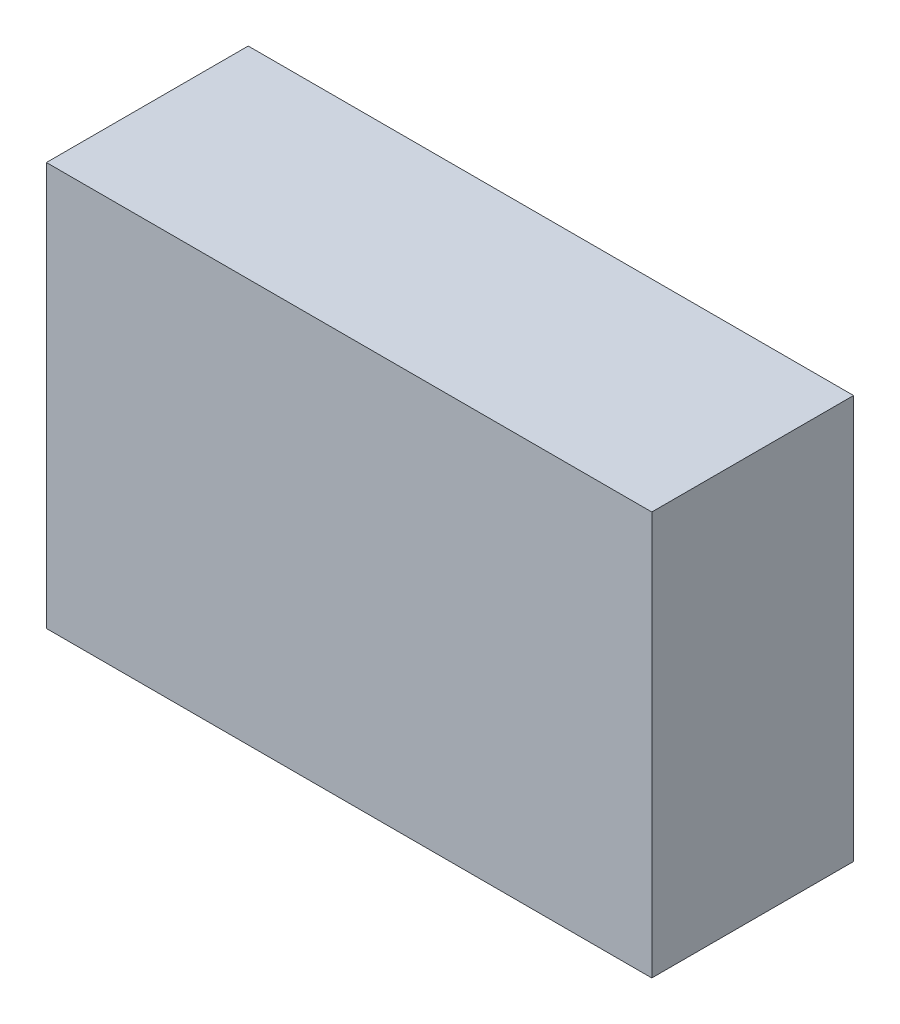
ISO-10303-21;
HEADER;
FILE_DESCRIPTION(('STEP AP214'),'2;1');
FILE_NAME('part.step','',(''),(''),'','','');
FILE_SCHEMA(('AUTOMOTIVE_DESIGN { 1 0 10303 214 1 1 1 1 }'));
ENDSEC;
DATA;
#1=APPLICATION_CONTEXT('core data for automotive mechanical design processes');
#2=APPLICATION_PROTOCOL_DEFINITION('international standard','automotive_design',2000,#1);
#3=PRODUCT_CONTEXT('',#1,'mechanical');
#4=PRODUCT('Part','Part','',(#3));
#5=PRODUCT_RELATED_PRODUCT_CATEGORY('part','',(#4));
#6=PRODUCT_DEFINITION_FORMATION('','',#4);
#7=PRODUCT_DEFINITION_CONTEXT('part definition',#1,'design');
#8=PRODUCT_DEFINITION('design','',#6,#7);
#9=PRODUCT_DEFINITION_SHAPE('','',#8);
#10=(LENGTH_UNIT() NAMED_UNIT(*) SI_UNIT(.MILLI.,.METRE.));
#11=(NAMED_UNIT(*) PLANE_ANGLE_UNIT() SI_UNIT($,.RADIAN.));
#12=(NAMED_UNIT(*) SI_UNIT($,.STERADIAN.) SOLID_ANGLE_UNIT());
#13=UNCERTAINTY_MEASURE_WITH_UNIT(LENGTH_MEASURE(1.E-05),#10,'distance_accuracy_value','');
#14=(GEOMETRIC_REPRESENTATION_CONTEXT(3) GLOBAL_UNCERTAINTY_ASSIGNED_CONTEXT((#13)) GLOBAL_UNIT_ASSIGNED_CONTEXT((#10,
#11,#12)) REPRESENTATION_CONTEXT('',''));
#15=CARTESIAN_POINT('',(0.,0.,0.));
#16=DIRECTION('',(0.,0.,1.));
#17=DIRECTION('',(1.,0.,0.));
#18=AXIS2_PLACEMENT_3D('',#15,#16,#17);
#19=CARTESIAN_POINT('',(0.,0.,25.4));
#20=DIRECTION('',(1.,0.,0.));
#21=DIRECTION('',(0.,0.,-1.));
#22=AXIS2_PLACEMENT_3D('',#19,#20,#21);
#23=PLANE('',#22);
#24=DIRECTION('',(0.,-1.,0.));
#25=VECTOR('',#24,1.);
#26=CARTESIAN_POINT('',(0.,0.,-25.4));
#27=LINE('',#26,#25);
#28=CARTESIAN_POINT('',(0.,101.6,-25.4));
#29=VERTEX_POINT('',#28);
#30=CARTESIAN_POINT('',(0.,0.,-25.4));
#31=VERTEX_POINT('',#30);
#32=EDGE_CURVE('E111',#29,#31,#27,.T.);
#33=ORIENTED_EDGE('',*,*,#32,.T.);
#34=DIRECTION('',(0.,0.,-1.));
#35=VECTOR('',#34,1.);
#36=CARTESIAN_POINT('',(0.,0.,25.4));
#37=LINE('',#36,#35);
#38=CARTESIAN_POINT('',(0.,0.,25.4));
#39=VERTEX_POINT('',#38);
#40=EDGE_CURVE('E11',#39,#31,#37,.T.);
#41=ORIENTED_EDGE('',*,*,#40,.F.);
#42=DIRECTION('',(0.,-1.,0.));
#43=VECTOR('',#42,1.);
#44=CARTESIAN_POINT('',(0.,0.,25.4));
#45=LINE('',#44,#43);
#46=CARTESIAN_POINT('',(0.,101.6,25.4));
#47=VERTEX_POINT('',#46);
#48=EDGE_CURVE('E95',#47,#39,#45,.T.);
#49=ORIENTED_EDGE('',*,*,#48,.F.);
#50=DIRECTION('',(0.,0.,-1.));
#51=VECTOR('',#50,1.);
#52=CARTESIAN_POINT('',(0.,101.6,25.4));
#53=LINE('',#52,#51);
#54=EDGE_CURVE('E107',#47,#29,#53,.T.);
#55=ORIENTED_EDGE('',*,*,#54,.T.);
#56=EDGE_LOOP('',(#33,#41,#49,#55));
#57=FACE_BOUND('',#56,.T.);
#58=ADVANCED_FACE('F43',(#57),#23,.F.);
#59=CARTESIAN_POINT('',(0.,0.,25.4));
#60=DIRECTION('',(0.,1.,0.));
#61=DIRECTION('',(0.,0.,1.));
#62=AXIS2_PLACEMENT_3D('',#59,#60,#61);
#63=PLANE('',#62);
#64=DIRECTION('',(1.,0.,0.));
#65=VECTOR('',#64,1.);
#66=CARTESIAN_POINT('',(0.,0.,-25.4));
#67=LINE('',#66,#65);
#68=CARTESIAN_POINT('',(152.4,0.,-25.4));
#69=VERTEX_POINT('',#68);
#70=EDGE_CURVE('E100',#31,#69,#67,.T.);
#71=ORIENTED_EDGE('',*,*,#70,.T.);
#72=DIRECTION('',(0.,0.,-1.));
#73=VECTOR('',#72,1.);
#74=CARTESIAN_POINT('',(152.4,0.,25.4));
#75=LINE('',#74,#73);
#76=CARTESIAN_POINT('',(152.4,0.,25.4));
#77=VERTEX_POINT('',#76);
#78=EDGE_CURVE('E52',#77,#69,#75,.T.);
#79=ORIENTED_EDGE('',*,*,#78,.F.);
#80=DIRECTION('',(1.,0.,0.));
#81=VECTOR('',#80,1.);
#82=CARTESIAN_POINT('',(0.,0.,25.4));
#83=LINE('',#82,#81);
#84=EDGE_CURVE('E90',#39,#77,#83,.T.);
#85=ORIENTED_EDGE('',*,*,#84,.F.);
#86=ORIENTED_EDGE('',*,*,#40,.T.);
#87=EDGE_LOOP('',(#71,#79,#85,#86));
#88=FACE_BOUND('',#87,.T.);
#89=ADVANCED_FACE('F99',(#88),#63,.F.);
#90=CARTESIAN_POINT('',(152.4,0.,25.4));
#91=DIRECTION('',(-1.,0.,0.));
#92=DIRECTION('',(0.,0.,1.));
#93=AXIS2_PLACEMENT_3D('',#90,#91,#92);
#94=PLANE('',#93);
#95=DIRECTION('',(0.,1.,0.));
#96=VECTOR('',#95,1.);
#97=CARTESIAN_POINT('',(152.4,0.,-25.4));
#98=LINE('',#97,#96);
#99=CARTESIAN_POINT('',(152.4,101.6,-25.4));
#100=VERTEX_POINT('',#99);
#101=EDGE_CURVE('E77',#69,#100,#98,.T.);
#102=ORIENTED_EDGE('',*,*,#101,.T.);
#103=DIRECTION('',(0.,0.,-1.));
#104=VECTOR('',#103,1.);
#105=CARTESIAN_POINT('',(152.4,101.6,25.4));
#106=LINE('',#105,#104);
#107=CARTESIAN_POINT('',(152.4,101.6,25.4));
#108=VERTEX_POINT('',#107);
#109=EDGE_CURVE('E102',#108,#100,#106,.T.);
#110=ORIENTED_EDGE('',*,*,#109,.F.);
#111=DIRECTION('',(0.,1.,0.));
#112=VECTOR('',#111,1.);
#113=CARTESIAN_POINT('',(152.4,0.,25.4));
#114=LINE('',#113,#112);
#115=EDGE_CURVE('E93',#77,#108,#114,.T.);
#116=ORIENTED_EDGE('',*,*,#115,.F.);
#117=ORIENTED_EDGE('',*,*,#78,.T.);
#118=EDGE_LOOP('',(#102,#110,#116,#117));
#119=FACE_BOUND('',#118,.T.);
#120=ADVANCED_FACE('F103',(#119),#94,.F.);
#121=CARTESIAN_POINT('',(0.,101.6,25.4));
#122=DIRECTION('',(0.,-1.,0.));
#123=DIRECTION('',(0.,0.,-1.));
#124=AXIS2_PLACEMENT_3D('',#121,#122,#123);
#125=PLANE('',#124);
#126=DIRECTION('',(-1.,0.,0.));
#127=VECTOR('',#126,1.);
#128=CARTESIAN_POINT('',(0.,101.6,-25.4));
#129=LINE('',#128,#127);
#130=EDGE_CURVE('E83',#100,#29,#129,.T.);
#131=ORIENTED_EDGE('',*,*,#130,.T.);
#132=ORIENTED_EDGE('',*,*,#54,.F.);
#133=DIRECTION('',(-1.,0.,0.));
#134=VECTOR('',#133,1.);
#135=CARTESIAN_POINT('',(0.,101.6,25.4));
#136=LINE('',#135,#134);
#137=EDGE_CURVE('E60',#108,#47,#136,.T.);
#138=ORIENTED_EDGE('',*,*,#137,.F.);
#139=ORIENTED_EDGE('',*,*,#109,.T.);
#140=EDGE_LOOP('',(#131,#132,#138,#139));
#141=FACE_BOUND('',#140,.T.);
#142=ADVANCED_FACE('F124',(#141),#125,.F.);
#143=CARTESIAN_POINT('',(0.,0.,25.4));
#144=DIRECTION('',(0.,0.,-1.));
#145=DIRECTION('',(-1.,0.,0.));
#146=AXIS2_PLACEMENT_3D('',#143,#144,#145);
#147=PLANE('',#146);
#148=ORIENTED_EDGE('',*,*,#48,.T.);
#149=ORIENTED_EDGE('',*,*,#84,.T.);
#150=ORIENTED_EDGE('',*,*,#115,.T.);
#151=ORIENTED_EDGE('',*,*,#137,.T.);
#152=EDGE_LOOP('',(#148,#149,#150,#151));
#153=FACE_BOUND('',#152,.T.);
#154=ADVANCED_FACE('F91',(#153),#147,.F.);
#155=CARTESIAN_POINT('',(0.,0.,-25.4));
#156=DIRECTION('',(0.,0.,-1.));
#157=DIRECTION('',(-1.,0.,0.));
#158=AXIS2_PLACEMENT_3D('',#155,#156,#157);
#159=PLANE('',#158);
#160=ORIENTED_EDGE('',*,*,#32,.F.);
#161=ORIENTED_EDGE('',*,*,#130,.F.);
#162=ORIENTED_EDGE('',*,*,#101,.F.);
#163=ORIENTED_EDGE('',*,*,#70,.F.);
#164=EDGE_LOOP('',(#160,#161,#162,#163));
#165=FACE_BOUND('',#164,.T.);
#166=ADVANCED_FACE('F127',(#165),#159,.T.);
#167=CLOSED_SHELL('',(#58,#89,#120,#142,#154,#166));
#168=MANIFOLD_SOLID_BREP('B2',#167);
#169=ADVANCED_BREP_SHAPE_REPRESENTATION('',(#18,#168),#14);
#170=SHAPE_DEFINITION_REPRESENTATION(#9,#169);
ENDSEC;
END-ISO-10303-21;
